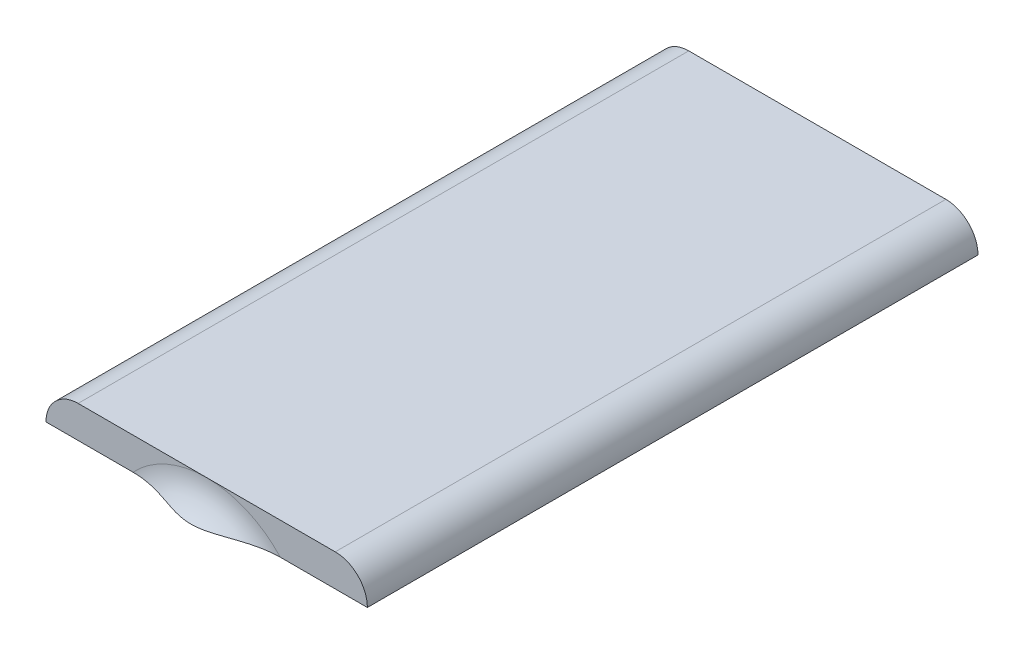
ISO-10303-21;
HEADER;
FILE_DESCRIPTION(('STEP AP214'),'2;1');
FILE_NAME('part.step','',(''),(''),'','','');
FILE_SCHEMA(('AUTOMOTIVE_DESIGN { 1 0 10303 214 1 1 1 1 }'));
ENDSEC;
DATA;
#1=APPLICATION_CONTEXT('core data for automotive mechanical design processes');
#2=APPLICATION_PROTOCOL_DEFINITION('international standard','automotive_design',2000,#1);
#3=PRODUCT_CONTEXT('',#1,'mechanical');
#4=PRODUCT('Part','Part','',(#3));
#5=PRODUCT_RELATED_PRODUCT_CATEGORY('part','',(#4));
#6=PRODUCT_DEFINITION_FORMATION('','',#4);
#7=PRODUCT_DEFINITION_CONTEXT('part definition',#1,'design');
#8=PRODUCT_DEFINITION('design','',#6,#7);
#9=PRODUCT_DEFINITION_SHAPE('','',#8);
#10=(LENGTH_UNIT() NAMED_UNIT(*) SI_UNIT(.MILLI.,.METRE.));
#11=(NAMED_UNIT(*) PLANE_ANGLE_UNIT() SI_UNIT($,.RADIAN.));
#12=(NAMED_UNIT(*) SI_UNIT($,.STERADIAN.) SOLID_ANGLE_UNIT());
#13=UNCERTAINTY_MEASURE_WITH_UNIT(LENGTH_MEASURE(1.E-05),#10,'distance_accuracy_value','');
#14=(GEOMETRIC_REPRESENTATION_CONTEXT(3) GLOBAL_UNCERTAINTY_ASSIGNED_CONTEXT((#13)) GLOBAL_UNIT_ASSIGNED_CONTEXT((#10,
#11,#12)) REPRESENTATION_CONTEXT('',''));
#15=CARTESIAN_POINT('',(0.,0.,0.));
#16=DIRECTION('',(0.,0.,1.));
#17=DIRECTION('',(1.,0.,0.));
#18=AXIS2_PLACEMENT_3D('',#15,#16,#17);
#19=CARTESIAN_POINT('',(-20.,8.5,10.01));
#20=DIRECTION('',(0.,1.,0.));
#21=DIRECTION('',(-1.,0.,0.));
#22=AXIS2_PLACEMENT_3D('',#19,#20,#21);
#23=PLANE('',#22);
#24=DIRECTION('',(-1.,0.,0.));
#25=VECTOR('',#24,1.);
#26=CARTESIAN_POINT('',(0.,8.49999999999999,-1.));
#27=LINE('',#26,#25);
#28=CARTESIAN_POINT('',(18.8729833462074,8.49999999999998,-1.));
#29=VERTEX_POINT('',#28);
#30=CARTESIAN_POINT('',(-18.8729833462074,8.5,-1.));
#31=VERTEX_POINT('',#30);
#32=EDGE_CURVE('E242',#29,#31,#27,.T.);
#33=ORIENTED_EDGE('',*,*,#32,.F.);
#34=DIRECTION('',(0.,0.,-1.));
#35=VECTOR('',#34,1.);
#36=CARTESIAN_POINT('',(18.8729833462074,8.49999999999998,-76.));
#37=LINE('',#36,#35);
#38=CARTESIAN_POINT('',(18.8729833462074,8.49999999999998,-76.));
#39=VERTEX_POINT('',#38);
#40=EDGE_CURVE('E191',#39,#29,#37,.F.);
#41=ORIENTED_EDGE('',*,*,#40,.F.);
#42=DIRECTION('',(1.,0.,0.));
#43=VECTOR('',#42,1.);
#44=CARTESIAN_POINT('',(0.,8.49999999999999,-76.));
#45=LINE('',#44,#43);
#46=CARTESIAN_POINT('',(20.,8.5,-76.));
#47=VERTEX_POINT('',#46);
#48=EDGE_CURVE('E156',#39,#47,#45,.T.);
#49=ORIENTED_EDGE('',*,*,#48,.T.);
#50=DIRECTION('',(0.,0.,1.));
#51=VECTOR('',#50,1.);
#52=CARTESIAN_POINT('',(20.,8.5,-1.));
#53=LINE('',#52,#51);
#54=CARTESIAN_POINT('',(20.,8.5,0.));
#55=VERTEX_POINT('',#54);
#56=EDGE_CURVE('E11',#47,#55,#53,.T.);
#57=ORIENTED_EDGE('',*,*,#56,.T.);
#58=DIRECTION('',(-1.,0.,0.));
#59=VECTOR('',#58,1.);
#60=CARTESIAN_POINT('',(0.,8.49999999999999,0.));
#61=LINE('',#60,#59);
#62=CARTESIAN_POINT('',(9.1651513899117,8.49999999999998,0.));
#63=VERTEX_POINT('',#62);
#64=EDGE_CURVE('E65',#55,#63,#61,.T.);
#65=ORIENTED_EDGE('',*,*,#64,.T.);
#66=CARTESIAN_POINT('',(0.,8.49999999999999,2.00000000000002));
#67=CARTESIAN_POINT('',(0.105152350395983,8.49999999999999,2.00000221259254));
#68=CARTESIAN_POINT('',(0.210298998756906,8.49999999999999,1.99739070368747));
#69=CARTESIAN_POINT('',(0.42034572113057,8.49999999999999,1.98704964671032));
#70=CARTESIAN_POINT('',(0.525245781803692,8.49999999999999,1.97931982786965));
#71=CARTESIAN_POINT('',(0.73486298021603,8.49999999999999,1.95899425906992));
#72=CARTESIAN_POINT('',(0.839578793785848,8.49999999999999,1.94638501052997));
#73=CARTESIAN_POINT('',(1.04837084678324,8.49999999999999,1.91673631174291));
#74=CARTESIAN_POINT('',(1.15244709736312,8.49999999999999,1.89969693897127));
#75=CARTESIAN_POINT('',(1.46642990391755,8.49999999999999,1.84218850126788));
#76=CARTESIAN_POINT('',(1.67522369713419,8.49999999999999,1.79563209095554));
#77=CARTESIAN_POINT('',(2.08969770750147,8.49999999999999,1.69123499207015));
#78=CARTESIAN_POINT('',(2.29537995452688,8.49999999999999,1.63340203519513));
#79=CARTESIAN_POINT('',(2.67184645669517,8.49999999999999,1.52059889951508));
#80=CARTESIAN_POINT('',(2.84294372378735,8.49999999999999,1.46665383010852));
#81=CARTESIAN_POINT('',(3.18424352849812,8.49999999999999,1.35600913320358));
#82=CARTESIAN_POINT('',(3.35444602414877,8.49999999999999,1.29930937775583));
#83=CARTESIAN_POINT('',(3.69461010478852,8.49999999999999,1.1849522034045));
#84=CARTESIAN_POINT('',(3.8645715483895,8.49999999999999,1.12729436846295));
#85=CARTESIAN_POINT('',(4.20470236944082,8.49999999999999,1.01257962518732));
#86=CARTESIAN_POINT('',(4.3748717512446,8.49999999999999,0.9555227296838));
#87=CARTESIAN_POINT('',(4.71492564168928,8.49999999999999,0.843641376637484));
#88=CARTESIAN_POINT('',(4.88480666732878,8.49999999999999,0.788806466457796));
#89=CARTESIAN_POINT('',(5.22552365385838,8.49999999999999,0.682196976105023));
#90=CARTESIAN_POINT('',(5.39635962136752,8.49999999999999,0.630422417173167));
#91=CARTESIAN_POINT('',(5.91066216199367,8.49999999999999,0.481295594893324));
#92=CARTESIAN_POINT('',(6.25599353005679,8.49999999999998,0.390116125139748));
#93=CARTESIAN_POINT('',(6.87448772997122,8.49999999999998,0.249612987801037));
#94=CARTESIAN_POINT('',(7.14654606910131,8.49999999999998,0.195489384455061));
#95=CARTESIAN_POINT('',(7.69360282976711,8.49999999999998,0.105219154060638));
#96=CARTESIAN_POINT('',(7.96860012368069,8.49999999999998,0.0690658683993698));
#97=CARTESIAN_POINT('',(8.52091269191232,8.49999999999998,0.0179831227448284));
#98=CARTESIAN_POINT('',(8.79823005765557,8.49999999999998,0.00307550877143504));
#99=CARTESIAN_POINT('',(9.35309645029777,8.49999999999998,-0.00221834348374518));
#100=CARTESIAN_POINT('',(9.63064529998875,8.49999999999998,0.00738354746609526));
#101=CARTESIAN_POINT('',(10.0957914470036,8.49999999999998,0.046714601124058));
#102=CARTESIAN_POINT('',(10.2840215782206,8.49999999999998,0.06910121648842));
#103=CARTESIAN_POINT('',(10.6583207584452,8.49999999999998,0.127612614267217));
#104=CARTESIAN_POINT('',(10.8443903733071,8.49999999999998,0.163733711884864));
#105=CARTESIAN_POINT('',(11.212890955012,8.49999999999998,0.250463663739517));
#106=CARTESIAN_POINT('',(11.3953262996903,8.49999999999998,0.301053798119982));
#107=CARTESIAN_POINT('',(11.7553048889751,8.49999999999998,0.417409793379787));
#108=CARTESIAN_POINT('',(11.9328488706118,8.49999999999998,0.483173353773766));
#109=CARTESIAN_POINT('',(12.2525958764997,8.49999999999998,0.618219552850558));
#110=CARTESIAN_POINT('',(12.3958001767723,8.49999999999998,0.685135096706459));
#111=CARTESIAN_POINT('',(12.6765319862256,8.49999999999998,0.830064369343367));
#112=CARTESIAN_POINT('',(12.8140586000983,8.49999999999998,0.908079839900541));
#113=CARTESIAN_POINT('',(13.0822294706484,8.49999999999998,1.07524167928402));
#114=CARTESIAN_POINT('',(13.2128723272721,8.49999999999998,1.16439030009716));
#115=CARTESIAN_POINT('',(13.4659503219349,8.49999999999998,1.35365559395905));
#116=CARTESIAN_POINT('',(13.5883865751732,8.49999999999998,1.45377077186669));
#117=CARTESIAN_POINT('',(13.8246553577133,8.49999999999998,1.6654758729366));
#118=CARTESIAN_POINT('',(13.938413431903,8.49999999999998,1.77714911101065));
#119=CARTESIAN_POINT('',(14.154818067776,8.49999999999998,2.01070811538585));
#120=CARTESIAN_POINT('',(14.2574700979499,8.49999999999998,2.1325888027216));
#121=CARTESIAN_POINT('',(14.4503256130799,8.49999999999998,2.38578211760428));
#122=CARTESIAN_POINT('',(14.5405333447314,8.49999999999998,2.51709150417299));
#123=CARTESIAN_POINT('',(14.7072304614101,8.49999999999998,2.7881441132429));
#124=CARTESIAN_POINT('',(14.7837221885785,8.49999999999998,2.92788589037417));
#125=CARTESIAN_POINT('',(14.9126247735831,8.49999999999998,3.19545284724255));
#126=CARTESIAN_POINT('',(14.9668855236494,8.49999999999998,3.32238969592003));
#127=CARTESIAN_POINT('',(15.0635591753504,8.49999999999998,3.58069288011773));
#128=CARTESIAN_POINT('',(15.1059735669904,8.49999999999998,3.71205865624708));
#129=CARTESIAN_POINT('',(15.1784010465613,8.49999999999998,3.97809722241245));
#130=CARTESIAN_POINT('',(15.2084203258523,8.49999999999998,4.11276832573512));
#131=CARTESIAN_POINT('',(15.2556942940673,8.49999999999998,4.38433264560028));
#132=CARTESIAN_POINT('',(15.272949716299,8.49999999999998,4.52122573402367));
#133=CARTESIAN_POINT('',(15.2935121425811,8.49999999999998,4.78379827286201));
#134=CARTESIAN_POINT('',(15.2979229574827,8.49999999999998,4.90939251610827));
#135=CARTESIAN_POINT('',(15.2959143952797,8.49999999999998,5.16053782679112));
#136=CARTESIAN_POINT('',(15.2894915681469,8.49999999999998,5.28608886773379));
#137=CARTESIAN_POINT('',(15.2658866985552,8.49999999999998,5.53610215619957));
#138=CARTESIAN_POINT('',(15.2487106722615,8.49999999999998,5.66056497310446));
#139=CARTESIAN_POINT('',(15.2037864676481,8.49999999999998,5.90761399598878));
#140=CARTESIAN_POINT('',(15.176034367009,8.49999999999998,6.030199488164));
#141=CARTESIAN_POINT('',(15.110867414279,8.49999999999998,6.27034340417592));
#142=CARTESIAN_POINT('',(15.0736401479179,8.49999999999998,6.38795284244734));
#143=CARTESIAN_POINT('',(14.989655983432,8.49999999999998,6.61976182210354));
#144=CARTESIAN_POINT('',(14.9428957164377,8.49999999999998,6.73396014162985));
#145=CARTESIAN_POINT('',(14.8403307817374,8.49999999999998,6.95816972468594));
#146=CARTESIAN_POINT('',(14.7845291169631,8.49999999999998,7.06818236348242));
#147=CARTESIAN_POINT('',(14.6643769060363,8.49999999999998,7.28348094325468));
#148=CARTESIAN_POINT('',(14.6000231454255,8.49999999999998,7.38876508693412));
#149=CARTESIAN_POINT('',(14.4604490555315,8.49999999999998,7.59839531552918));
#150=CARTESIAN_POINT('',(14.3848832681598,8.49999999999998,7.70251160535641));
#151=CARTESIAN_POINT('',(14.225792778184,8.49999999999998,7.90449462949111));
#152=CARTESIAN_POINT('',(14.1422651763385,8.49999999999998,8.00235906539486));
#153=CARTESIAN_POINT('',(13.8808316760334,8.49999999999998,8.28589054465437));
#154=CARTESIAN_POINT('',(13.6919828370406,8.49999999999998,8.46163278815322));
#155=CARTESIAN_POINT('',(13.2716482353414,8.49999999999998,8.79992638106247));
#156=CARTESIAN_POINT('',(13.0377993963288,8.49999999999998,8.95951092400368));
#157=CARTESIAN_POINT('',(12.5494140090783,8.49999999999998,9.24317179653353));
#158=CARTESIAN_POINT('',(12.2948650238935,8.49999999999998,9.36722657390813));
#159=CARTESIAN_POINT('',(11.8476771576099,8.49999999999998,9.54952451659199));
#160=CARTESIAN_POINT('',(11.6584758204459,8.49999999999998,9.61642119170653));
#161=CARTESIAN_POINT('',(11.2748603417463,8.49999999999998,9.73333595371027));
#162=CARTESIAN_POINT('',(11.0804444330494,8.49999999999998,9.7833482386167));
#163=CARTESIAN_POINT('',(10.6881568699474,8.49999999999998,9.86729312906266));
#164=CARTESIAN_POINT('',(10.490284299209,8.49999999999998,9.90122140167707));
#165=CARTESIAN_POINT('',(10.0925181271397,8.49999999999998,9.9539879049034));
#166=CARTESIAN_POINT('',(9.89262394309161,8.49999999999998,9.97282165137347));
#167=CARTESIAN_POINT('',(9.40233392761441,8.49999999999998,10.0017701274676));
#168=CARTESIAN_POINT('',(9.11147528398776,8.49999999999998,10.0042096080169));
#169=CARTESIAN_POINT('',(8.53058712758544,8.49999999999998,9.98327477280325));
#170=CARTESIAN_POINT('',(8.24055854190776,8.49999999999998,9.95987827622496));
#171=CARTESIAN_POINT('',(7.66062285309475,8.49999999999998,9.89067542838672));
#172=CARTESIAN_POINT('',(7.37074030235592,8.49999999999998,9.84466942051028));
#173=CARTESIAN_POINT('',(6.79504849558419,8.49999999999998,9.73418050310991));
#174=CARTESIAN_POINT('',(6.50923386170419,8.49999999999999,9.66972494949724));
#175=CARTESIAN_POINT('',(5.97274571272873,8.49999999999999,9.53431545188217));
#176=CARTESIAN_POINT('',(5.72168347007245,8.49999999999999,9.46486992399547));
#177=CARTESIAN_POINT('',(5.22201608846108,8.49999999999999,9.31759982810571));
#178=CARTESIAN_POINT('',(4.97341137487337,8.49999999999999,9.23977383634501));
#179=CARTESIAN_POINT('',(4.47637426606136,8.49999999999999,9.07866015439305));
#180=CARTESIAN_POINT('',(4.22795166195153,8.49999999999999,8.99534277368388));
#181=CARTESIAN_POINT('',(3.73145982259427,8.49999999999999,8.8277098952498));
#182=CARTESIAN_POINT('',(3.48339057636637,8.49999999999999,8.74339442933305));
#183=CARTESIAN_POINT('',(2.99456332282083,8.49999999999999,8.58168241922474));
#184=CARTESIAN_POINT('',(2.75385243641007,8.49999999999999,8.50414708809212));
#185=CARTESIAN_POINT('',(2.26939493350961,8.49999999999999,8.35864577869759));
#186=CARTESIAN_POINT('',(2.02564738340937,8.49999999999999,8.29068282661106));
#187=CARTESIAN_POINT('',(1.5370013811639,8.49999999999999,8.17247116090103));
#188=CARTESIAN_POINT('',(1.29215886883384,8.49999999999999,8.12200410679422));
#189=CARTESIAN_POINT('',(0.922195041994337,8.49999999999999,8.06434407092854));
#190=CARTESIAN_POINT('',(0.798478077751569,8.49999999999999,8.04813394618438));
#191=CARTESIAN_POINT('',(0.550336236164693,8.49999999999999,8.02244624233946));
#192=CARTESIAN_POINT('',(0.425911375393601,8.49999999999999,8.01296850627091));
#193=CARTESIAN_POINT('',(0.170942146293617,8.49999999999999,8.00097055418317));
#194=CARTESIAN_POINT('',(0.0403812828877034,8.49999999999999,7.99879294783874));
#195=CARTESIAN_POINT('',(-0.220626323455768,8.49999999999999,8.00248085637764));
#196=CARTESIAN_POINT('',(-0.351073064371248,8.49999999999999,8.00834651099867));
#197=CARTESIAN_POINT('',(-0.611496596199138,8.49999999999999,8.02778872820287));
#198=CARTESIAN_POINT('',(-0.741472871499637,8.49999999999999,8.04137208326543));
#199=CARTESIAN_POINT('',(-1.00049392530616,8.49999999999999,8.0755162689781));
#200=CARTESIAN_POINT('',(-1.12953866116156,8.49999999999999,8.09607741706368));
#201=CARTESIAN_POINT('',(-1.51822345283902,8.49999999999999,8.16735879907373));
#202=CARTESIAN_POINT('',(-1.77614535466746,8.49999999999999,8.22738997430267));
#203=CARTESIAN_POINT('',(-2.28765758534091,8.49999999999999,8.36306916036679));
#204=CARTESIAN_POINT('',(-2.54124693022877,8.49999999999999,8.43872066896674));
#205=CARTESIAN_POINT('',(-3.05444674413719,8.49999999999999,8.60052809962301));
#206=CARTESIAN_POINT('',(-3.3139703905254,8.49999999999999,8.68695294633474));
#207=CARTESIAN_POINT('',(-3.83236957641188,8.49999999999999,8.86151776900769));
#208=CARTESIAN_POINT('',(-4.09124522252778,8.49999999999999,8.9496574385788));
#209=CARTESIAN_POINT('',(-4.60862977770645,8.49999999999999,9.12203671993077));
#210=CARTESIAN_POINT('',(-4.86713194005456,8.49999999999999,9.20629616593248));
#211=CARTESIAN_POINT('',(-5.38645813866802,8.49999999999999,9.36732414295811));
#212=CARTESIAN_POINT('',(-5.64728182431097,8.49999999999999,9.44409378490939));
#213=CARTESIAN_POINT('',(-6.15529372106968,8.49999999999999,9.58202058746743));
#214=CARTESIAN_POINT('',(-6.40229402873017,8.49999999999999,9.64386020115533));
#215=CARTESIAN_POINT('',(-6.89947485729228,8.49999999999999,9.75516651103879));
#216=CARTESIAN_POINT('',(-7.14965934444339,8.49999999999999,9.80461577366555));
#217=CARTESIAN_POINT('',(-7.65054512937637,8.49999999999999,9.88805136037542));
#218=CARTESIAN_POINT('',(-7.90122556607985,8.49999999999999,9.92216052232583));
#219=CARTESIAN_POINT('',(-8.40428229510906,8.49999999999999,9.97298529283649));
#220=CARTESIAN_POINT('',(-8.65665776858856,8.49999999999999,9.98970876628851));
#221=CARTESIAN_POINT('',(-9.16720678227925,8.49999999999999,10.0034845458831));
#222=CARTESIAN_POINT('',(-9.42539281262439,8.49999999999999,10.0001251855111));
#223=CARTESIAN_POINT('',(-9.94058498718229,8.49999999999999,9.97026331751273));
#224=CARTESIAN_POINT('',(-10.1975907317184,8.49999999999999,9.94375347887848));
#225=CARTESIAN_POINT('',(-10.7074935707679,8.49999999999999,9.86531024544228));
#226=CARTESIAN_POINT('',(-10.9603946160195,8.49999999999999,9.81340300443286));
#227=CARTESIAN_POINT('',(-11.4589438167466,8.49999999999999,9.68219434533117));
#228=CARTESIAN_POINT('',(-11.7045974472413,8.5,9.60291421264339));
#229=CARTESIAN_POINT('',(-12.0917505908485,8.5,9.45180550707142));
#230=CARTESIAN_POINT('',(-12.2367943620558,8.5,9.38894937701312));
#231=CARTESIAN_POINT('',(-12.521575220929,8.5,9.25220905058261));
#232=CARTESIAN_POINT('',(-12.6613137348442,8.5,9.17832784487291));
#233=CARTESIAN_POINT('',(-12.934304577498,8.5,9.01946859211034));
#234=CARTESIAN_POINT('',(-13.0675584247777,8.5,8.93449316037086));
#235=CARTESIAN_POINT('',(-13.3263753240656,8.5,8.75350108202155));
#236=CARTESIAN_POINT('',(-13.4519380372715,8.5,8.65748394954884));
#237=CARTESIAN_POINT('',(-13.6949828434978,8.5,8.45388356588069));
#238=CARTESIAN_POINT('',(-13.8123953703648,8.5,8.34621704840909));
#239=CARTESIAN_POINT('',(-14.0366743909484,8.5,8.1204115794999));
#240=CARTESIAN_POINT('',(-14.1435421961545,8.5,8.00227393387704));
#241=CARTESIAN_POINT('',(-14.345328794782,8.5,7.75626010359892));
#242=CARTESIAN_POINT('',(-14.4402523290938,8.5,7.62838781534605));
#243=CARTESIAN_POINT('',(-14.6168602758124,8.5,7.36380653099042));
#244=CARTESIAN_POINT('',(-14.6985467416366,8.5,7.22709891009137));
#245=CARTESIAN_POINT('',(-14.838389973938,8.5,6.96314682614533));
#246=CARTESIAN_POINT('',(-14.8982006047673,8.5,6.83677643353394));
#247=CARTESIAN_POINT('',(-15.0059368757583,8.5,6.57907249841518));
#248=CARTESIAN_POINT('',(-15.0538640834647,8.5,6.44773961314782));
#249=CARTESIAN_POINT('',(-15.1372024434313,8.5,6.18122886532751));
#250=CARTESIAN_POINT('',(-15.1726197517001,8.5,6.0460529293895));
#251=CARTESIAN_POINT('',(-15.2304992377843,8.5,5.77295575188385));
#252=CARTESIAN_POINT('',(-15.2529623105624,8.5,5.63503470064782));
#253=CARTESIAN_POINT('',(-15.2831229046402,8.5,5.37090241600618));
#254=CARTESIAN_POINT('',(-15.2920230278337,8.5,5.24482709307061));
#255=CARTESIAN_POINT('',(-15.2988762692403,8.5,4.99233494886587));
#256=CARTESIAN_POINT('',(-15.2968259101566,8.5,4.86591803186283));
#257=CARTESIAN_POINT('',(-15.2817967596544,8.5,4.61381358651196));
#258=CARTESIAN_POINT('',(-15.2688245107871,8.5,4.48812566684704));
#259=CARTESIAN_POINT('',(-15.2320991851372,8.5,4.23828822472262));
#260=CARTESIAN_POINT('',(-15.2083421240398,8.5,4.11413928825031));
#261=CARTESIAN_POINT('',(-15.1510362885981,8.5,3.87140496892541));
#262=CARTESIAN_POINT('',(-15.1177472761768,8.5,3.75275809742434));
#263=CARTESIAN_POINT('',(-15.0415000990784,8.5,3.51856982723389));
#264=CARTESIAN_POINT('',(-14.9985385264339,8.5,3.40302953919874));
#265=CARTESIAN_POINT('',(-14.9033978456138,8.5,3.17586122127706));
#266=CARTESIAN_POINT('',(-14.8512220142937,8.5,3.06423181742453));
#267=CARTESIAN_POINT('',(-14.7381237248688,8.5,2.84545076731303));
#268=CARTESIAN_POINT('',(-14.6771979780764,8.5,2.73830082431421));
#269=CARTESIAN_POINT('',(-14.544773143565,8.5,2.5252369507554));
#270=CARTESIAN_POINT('',(-14.4729677056394,8.5,2.41951325197459));
#271=CARTESIAN_POINT('',(-14.3212297572969,8.5,2.21404927733615));
#272=CARTESIAN_POINT('',(-14.2412942915607,8.5,2.11431119839014));
#273=CARTESIAN_POINT('',(-13.9903461508326,8.5,1.82480426433536));
#274=CARTESIAN_POINT('',(-13.8081050278352,8.5,1.64460472831149));
#275=CARTESIAN_POINT('',(-13.4017476953845,8.5,1.29713864081541));
#276=CARTESIAN_POINT('',(-13.1753181926289,8.5,1.13260540735627));
#277=CARTESIAN_POINT('',(-12.700901987371,8.5,0.838235635364617));
#278=CARTESIAN_POINT('',(-12.4529052315294,8.5,0.708415394047156));
#279=CARTESIAN_POINT('',(-12.0182993743924,8.5,0.516761487945382));
#280=CARTESIAN_POINT('',(-11.8354450760456,8.5,0.446199128078776));
#281=CARTESIAN_POINT('',(-11.4641841772041,8.5,0.321386804605866));
#282=CARTESIAN_POINT('',(-11.2757757456325,8.49999999999999,0.26714228819258));
#283=CARTESIAN_POINT('',(-10.894986635551,8.49999999999999,0.174248299375225));
#284=CARTESIAN_POINT('',(-10.7026020896644,8.49999999999999,0.135614841598354));
#285=CARTESIAN_POINT('',(-10.3155010613842,8.49999999999999,0.0731340844065417));
#286=CARTESIAN_POINT('',(-10.1207847651407,8.49999999999999,0.0492856125815113));
#287=CARTESIAN_POINT('',(-9.64804265496463,8.49999999999999,0.00825481419880368));
#288=CARTESIAN_POINT('',(-9.36939923722985,8.49999999999999,-0.00191273417702614));
#289=CARTESIAN_POINT('',(-8.81219783234067,8.49999999999999,0.00250491853848194));
#290=CARTESIAN_POINT('',(-8.53364013071271,8.49999999999999,0.0171116750989745));
#291=CARTESIAN_POINT('',(-7.97681639557285,8.49999999999999,0.0680108304398643));
#292=CARTESIAN_POINT('',(-7.69856323126912,8.49999999999999,0.104439131764387));
#293=CARTESIAN_POINT('',(-7.1456008173067,8.49999999999999,0.195607150666932));
#294=CARTESIAN_POINT('',(-6.87088669647126,8.49999999999999,0.250318077150725));
#295=CARTESIAN_POINT('',(-6.31700095061199,8.49999999999999,0.376375753798967));
#296=CARTESIAN_POINT('',(-6.03792998548801,8.49999999999999,0.448157628732343));
#297=CARTESIAN_POINT('',(-5.6217994743589,8.49999999999999,0.56460971138427));
#298=CARTESIAN_POINT('',(-5.48348051088825,8.49999999999999,0.604897275128311));
#299=CARTESIAN_POINT('',(-5.207560988575,8.49999999999999,0.687857032466175));
#300=CARTESIAN_POINT('',(-5.06996041377347,8.49999999999999,0.730529172838233));
#301=CARTESIAN_POINT('',(-4.65631566726706,8.49999999999999,0.861834936781911));
#302=CARTESIAN_POINT('',(-4.38116559962829,8.49999999999999,0.953257174370644));
#303=CARTESIAN_POINT('',(-3.8315930798443,8.49999999999999,1.13826756973078));
#304=CARTESIAN_POINT('',(-3.55717067822723,8.49999999999999,1.23185587373703));
#305=CARTESIAN_POINT('',(-3.01435927921297,8.49999999999999,1.41204790288449));
#306=CARTESIAN_POINT('',(-2.74601118532509,8.49999999999999,1.49877278292717));
#307=CARTESIAN_POINT('',(-2.20535768892762,8.49999999999999,1.65994271404873));
#308=CARTESIAN_POINT('',(-1.93305120190449,8.49999999999999,1.73438432805342));
#309=CARTESIAN_POINT('',(-1.52202086267759,8.49999999999999,1.82872971574828));
#310=CARTESIAN_POINT('',(-1.38528728191344,8.49999999999999,1.85718996338336));
#311=CARTESIAN_POINT('',(-1.1105789795402,8.49999999999999,1.90721719304996));
#312=CARTESIAN_POINT('',(-0.972604582910851,8.49999999999999,1.92878592890254));
#313=CARTESIAN_POINT('',(-0.695801249774455,8.49999999999999,1.96383252682039));
#314=CARTESIAN_POINT('',(-0.55697370028772,8.49999999999999,1.97732115378597));
#315=CARTESIAN_POINT('',(-0.278760654539624,8.49999999999999,1.99540222756443));
#316=CARTESIAN_POINT('',(-0.139375318470123,8.49999999999999,1.99999706729536));
#317=CARTESIAN_POINT('',(0.,8.49999999999999,2.00000000000002));
#318=B_SPLINE_CURVE_WITH_KNOTS('',3,(#66,#67,#68,#69,#70,#71,#72,#73,#74,#75,#76,#77,#78,#79,
#80,#81,#82,#83,#84,#85,#86,#87,#88,#89,#90,#91,#92,#93,#94,#95,#96,#97,#98,#99,#100,#101,#102,
#103,#104,#105,#106,#107,#108,#109,#110,#111,#112,#113,#114,#115,#116,#117,#118,#119,#120,#121,
#122,#123,#124,#125,#126,#127,#128,#129,#130,#131,#132,#133,#134,#135,#136,#137,#138,#139,#140,
#141,#142,#143,#144,#145,#146,#147,#148,#149,#150,#151,#152,#153,#154,#155,#156,#157,#158,#159,
#160,#161,#162,#163,#164,#165,#166,#167,#168,#169,#170,#171,#172,#173,#174,#175,#176,#177,#178,
#179,#180,#181,#182,#183,#184,#185,#186,#187,#188,#189,#190,#191,#192,#193,#194,#195,#196,#197,
#198,#199,#200,#201,#202,#203,#204,#205,#206,#207,#208,#209,#210,#211,#212,#213,#214,#215,#216,
#217,#218,#219,#220,#221,#222,#223,#224,#225,#226,#227,#228,#229,#230,#231,#232,#233,#234,#235,
#236,#237,#238,#239,#240,#241,#242,#243,#244,#245,#246,#247,#248,#249,#250,#251,#252,#253,#254,
#255,#256,#257,#258,#259,#260,#261,#262,#263,#264,#265,#266,#267,#268,#269,#270,#271,#272,#273,
#274,#275,#276,#277,#278,#279,#280,#281,#282,#283,#284,#285,#286,#287,#288,#289,#290,#291,#292,
#293,#294,#295,#296,#297,#298,#299,#300,#301,#302,#303,#304,#305,#306,#307,#308,#309,#310,#311,
#312,#313,#314,#315,#316,#317),.UNSPECIFIED.,.T.,.F.,(4,2,2,2,2,2,2,2,2,2,2,2,2,2,2,2,2,2,2,2,2,
2,2,2,2,2,2,2,2,2,2,2,2,2,2,2,2,2,2,2,2,2,2,2,2,2,2,2,2,2,2,2,2,2,2,2,2,2,2,2,2,2,2,2,2,2,2,2,2,
2,2,2,2,2,2,2,2,2,2,2,2,2,2,2,2,2,2,2,2,2,2,2,2,2,2,2,2,2,2,2,2,2,2,2,2,2,2,2,2,2,2,2,2,2,2,2,2,
2,2,2,2,2,2,2,2,4),(0.,0.315415538976836,0.630847765384356,0.947158922934194,1.26346454910299,
1.90469880437228,2.54549493741309,3.08365601871096,3.62184212039917,4.16026837089096,
4.69870609403131,5.23421582060143,5.76972926359119,6.84053380331758,7.67222107545717,
8.50359994907191,9.33583307892036,10.167663207075,10.735888298042,11.3039610484777,
11.8713021327766,12.4385572573706,12.9123045241466,13.3861262124619,13.8600439000019,
14.3338970555323,14.8114416249139,15.2887499762151,15.7658950379477,16.2429585447712,
16.6565471825343,17.0700837767023,17.4834135586787,17.8967195922309,18.2732762729558,
18.6499528927055,19.0264189587335,19.4030247797802,19.7726871191403,20.1424803207279,
20.5121509532153,20.8819609281106,21.267478777068,21.6531375500022,22.4239648791329,
23.2701108835109,24.1167690748217,24.7180554398834,25.3195482151612,25.9212029366095,
26.5230363258821,27.3942351848798,28.2661825712104,29.1459720530226,30.0244637324007,
30.8057413104347,31.5871518298138,32.3732028961357,33.159228978731,33.9178123577298,
34.6766350166791,35.4256148133679,35.7997798198546,36.1739361022792,36.5654234212448,
36.9569175417094,37.348756757727,37.7406138017806,38.5341264555294,39.3278169887414,
40.1483788806757,40.9687954839723,41.7844025677705,42.5998884919017,43.3635054110169,
44.1281908021273,44.8866388180275,45.6447435797221,46.4184408615361,47.1923832371378,
47.9655302927612,48.7380774913511,49.2118999579793,49.6855941283577,50.1591768327064,
50.6327803838771,51.1100259886934,51.5872121615294,52.0642083293202,52.5411304314846,
52.9599915858237,53.3787974586754,53.7973969528745,54.2159675240359,54.5946700167813,
54.9734927726523,55.3520887632496,55.7308247353964,56.1000881369477,56.4694818465494,
56.8387444526978,57.208146212548,57.5911273635312,57.9742482316847,58.7400063906034,
59.5765174539527,60.4134205595429,61.0006825045091,61.5881402712074,62.1761991616286,
62.7642114145762,63.5993677473808,64.4352511004987,65.276395182738,66.1162208427127,
66.9803202428788,67.4125052136515,67.8446805422654,68.7144523689331,69.5842830876608,
70.4302617732833,71.2764767786788,71.6953260461756,72.1140686356506,72.5322520982582,
72.95032303086),.UNSPECIFIED.);
#319=CARTESIAN_POINT('',(-9.16515138991169,8.49999999999999,0.));
#320=VERTEX_POINT('',#319);
#321=EDGE_CURVE('E185',#320,#63,#318,.T.);
#322=ORIENTED_EDGE('',*,*,#321,.F.);
#323=DIRECTION('',(-1.,0.,0.));
#324=VECTOR('',#323,1.);
#325=CARTESIAN_POINT('',(0.,8.49999999999999,0.));
#326=LINE('',#325,#324);
#327=CARTESIAN_POINT('',(-20.,8.5,0.));
#328=VERTEX_POINT('',#327);
#329=EDGE_CURVE('E247',#320,#328,#326,.T.);
#330=ORIENTED_EDGE('',*,*,#329,.T.);
#331=DIRECTION('',(0.,0.,1.));
#332=VECTOR('',#331,1.);
#333=CARTESIAN_POINT('',(-20.,8.5,-1.));
#334=LINE('',#333,#332);
#335=CARTESIAN_POINT('',(-20.,8.5,-76.));
#336=VERTEX_POINT('',#335);
#337=EDGE_CURVE('E57',#328,#336,#334,.F.);
#338=ORIENTED_EDGE('',*,*,#337,.T.);
#339=CARTESIAN_POINT('',(-18.8729833462074,8.5,-76.));
#340=VERTEX_POINT('',#339);
#341=EDGE_CURVE('E272',#336,#340,#45,.T.);
#342=ORIENTED_EDGE('',*,*,#341,.T.);
#343=DIRECTION('',(0.,0.,-1.));
#344=VECTOR('',#343,1.);
#345=CARTESIAN_POINT('',(-18.8729833462074,8.5,-76.));
#346=LINE('',#345,#344);
#347=EDGE_CURVE('E51',#31,#340,#346,.T.);
#348=ORIENTED_EDGE('',*,*,#347,.F.);
#349=EDGE_LOOP('',(#33,#41,#49,#57,#65,#322,#330,#338,#342,#348));
#350=FACE_BOUND('',#349,.T.);
#351=ADVANCED_FACE('F47',(#350),#23,.F.);
#352=CARTESIAN_POINT('',(-20.,12.5,-1.));
#353=DIRECTION('',(0.,1.,0.));
#354=DIRECTION('',(0.,0.,1.));
#355=AXIS2_PLACEMENT_3D('',#352,#353,#354);
#356=PLANE('',#355);
#357=DIRECTION('',(-1.,0.,0.));
#358=VECTOR('',#357,1.);
#359=CARTESIAN_POINT('',(-20.,12.5,0.));
#360=LINE('',#359,#358);
#361=CARTESIAN_POINT('',(16.,12.5,0.));
#362=VERTEX_POINT('',#361);
#363=CARTESIAN_POINT('',(0.,12.5,0.));
#364=VERTEX_POINT('',#363);
#365=EDGE_CURVE('E125',#362,#364,#360,.T.);
#366=ORIENTED_EDGE('',*,*,#365,.F.);
#367=DIRECTION('',(0.,0.,1.));
#368=VECTOR('',#367,1.);
#369=CARTESIAN_POINT('',(16.,12.5,-1.));
#370=LINE('',#369,#368);
#371=CARTESIAN_POINT('',(16.,12.5,-76.));
#372=VERTEX_POINT('',#371);
#373=EDGE_CURVE('E135',#362,#372,#370,.F.);
#374=ORIENTED_EDGE('',*,*,#373,.T.);
#375=DIRECTION('',(1.,0.,0.));
#376=VECTOR('',#375,1.);
#377=CARTESIAN_POINT('',(-20.,12.5,-76.));
#378=LINE('',#377,#376);
#379=CARTESIAN_POINT('',(-16.,12.5,-76.));
#380=VERTEX_POINT('',#379);
#381=EDGE_CURVE('E257',#380,#372,#378,.T.);
#382=ORIENTED_EDGE('',*,*,#381,.F.);
#383=DIRECTION('',(0.,0.,1.));
#384=VECTOR('',#383,1.);
#385=CARTESIAN_POINT('',(-16.,12.5,-1.));
#386=LINE('',#385,#384);
#387=CARTESIAN_POINT('',(-16.,12.5,0.));
#388=VERTEX_POINT('',#387);
#389=EDGE_CURVE('E128',#380,#388,#386,.T.);
#390=ORIENTED_EDGE('',*,*,#389,.T.);
#391=EDGE_CURVE('E138',#364,#388,#360,.T.);
#392=ORIENTED_EDGE('',*,*,#391,.F.);
#393=EDGE_LOOP('',(#366,#374,#382,#390,#392));
#394=FACE_BOUND('',#393,.T.);
#395=ADVANCED_FACE('F133',(#394),#356,.T.);
#396=CARTESIAN_POINT('',(0.,0.,0.));
#397=DIRECTION('',(0.,0.,1.));
#398=DIRECTION('',(1.,0.,0.));
#399=AXIS2_PLACEMENT_3D('',#396,#397,#398);
#400=PLANE('',#399);
#401=ORIENTED_EDGE('',*,*,#64,.F.);
#402=CARTESIAN_POINT('',(16.,8.5,0.));
#403=DIRECTION('',(0.,0.,1.));
#404=DIRECTION('',(1.,0.,0.));
#405=AXIS2_PLACEMENT_3D('',#402,#403,#404);
#406=CIRCLE('',#405,4.);
#407=EDGE_CURVE('E122',#55,#362,#406,.T.);
#408=ORIENTED_EDGE('',*,*,#407,.T.);
#409=ORIENTED_EDGE('',*,*,#365,.T.);
#410=CARTESIAN_POINT('',(0.,0.,0.));
#411=DIRECTION('',(0.,0.,1.));
#412=DIRECTION('',(1.,0.,0.));
#413=AXIS2_PLACEMENT_3D('',#410,#411,#412);
#414=CIRCLE('',#413,12.5);
#415=EDGE_CURVE('E179',#364,#63,#414,.F.);
#416=ORIENTED_EDGE('',*,*,#415,.T.);
#417=EDGE_LOOP('',(#401,#408,#409,#416));
#418=FACE_BOUND('',#417,.T.);
#419=ADVANCED_FACE('F124',(#418),#400,.T.);
#420=ORIENTED_EDGE('',*,*,#329,.F.);
#421=CARTESIAN_POINT('',(0.,0.,0.));
#422=DIRECTION('',(0.,0.,1.));
#423=DIRECTION('',(1.,0.,0.));
#424=AXIS2_PLACEMENT_3D('',#421,#422,#423);
#425=CIRCLE('',#424,12.5);
#426=EDGE_CURVE('E182',#320,#364,#425,.F.);
#427=ORIENTED_EDGE('',*,*,#426,.T.);
#428=ORIENTED_EDGE('',*,*,#391,.T.);
#429=CARTESIAN_POINT('',(-16.,8.5,0.));
#430=DIRECTION('',(0.,0.,1.));
#431=DIRECTION('',(1.,0.,0.));
#432=AXIS2_PLACEMENT_3D('',#429,#430,#431);
#433=CIRCLE('',#432,4.);
#434=EDGE_CURVE('E129',#388,#328,#433,.T.);
#435=ORIENTED_EDGE('',*,*,#434,.T.);
#436=EDGE_LOOP('',(#420,#427,#428,#435));
#437=FACE_BOUND('',#436,.T.);
#438=ADVANCED_FACE('F198',(#437),#400,.T.);
#439=CARTESIAN_POINT('',(0.,0.,5.));
#440=DIRECTION('',(0.,0.,1.));
#441=DIRECTION('',(1.,0.,0.));
#442=AXIS2_PLACEMENT_3D('',#439,#440,#441);
#443=TOROIDAL_SURFACE('',#442,12.5,5.);
#444=ORIENTED_EDGE('',*,*,#426,.F.);
#445=ORIENTED_EDGE('',*,*,#321,.T.);
#446=ORIENTED_EDGE('',*,*,#415,.F.);
#447=EDGE_LOOP('',(#444,#445,#446));
#448=FACE_BOUND('',#447,.T.);
#449=ADVANCED_FACE('F193',(#448),#443,.F.);
#450=CARTESIAN_POINT('',(-19.,11.5,-76.));
#451=DIRECTION('',(0.,-1.,0.));
#452=DIRECTION('',(1.,0.,0.));
#453=AXIS2_PLACEMENT_3D('',#450,#451,#452);
#454=PLANE('',#453);
#455=DIRECTION('',(1.,0.,0.));
#456=VECTOR('',#455,1.);
#457=CARTESIAN_POINT('',(-19.,11.5,-1.));
#458=LINE('',#457,#456);
#459=CARTESIAN_POINT('',(-15.,11.5,-1.));
#460=VERTEX_POINT('',#459);
#461=CARTESIAN_POINT('',(15.,11.5,-1.));
#462=VERTEX_POINT('',#461);
#463=EDGE_CURVE('E249',#460,#462,#458,.T.);
#464=ORIENTED_EDGE('',*,*,#463,.F.);
#465=DIRECTION('',(0.,0.,1.));
#466=VECTOR('',#465,1.);
#467=CARTESIAN_POINT('',(-15.,11.5,-76.));
#468=LINE('',#467,#466);
#469=CARTESIAN_POINT('',(-15.,11.5,-76.));
#470=VERTEX_POINT('',#469);
#471=EDGE_CURVE('E164',#460,#470,#468,.F.);
#472=ORIENTED_EDGE('',*,*,#471,.T.);
#473=DIRECTION('',(1.,0.,0.));
#474=VECTOR('',#473,1.);
#475=CARTESIAN_POINT('',(-19.,11.5,-76.));
#476=LINE('',#475,#474);
#477=CARTESIAN_POINT('',(15.,11.5,-76.));
#478=VERTEX_POINT('',#477);
#479=EDGE_CURVE('E254',#470,#478,#476,.T.);
#480=ORIENTED_EDGE('',*,*,#479,.T.);
#481=DIRECTION('',(0.,0.,1.));
#482=VECTOR('',#481,1.);
#483=CARTESIAN_POINT('',(15.,11.5,-1.));
#484=LINE('',#483,#482);
#485=EDGE_CURVE('E160',#478,#462,#484,.T.);
#486=ORIENTED_EDGE('',*,*,#485,.T.);
#487=EDGE_LOOP('',(#464,#472,#480,#486));
#488=FACE_BOUND('',#487,.T.);
#489=ADVANCED_FACE('F197',(#488),#454,.T.);
#490=CARTESIAN_POINT('',(0.,0.,-1.));
#491=DIRECTION('',(0.,0.,1.));
#492=DIRECTION('',(1.,0.,0.));
#493=AXIS2_PLACEMENT_3D('',#490,#491,#492);
#494=PLANE('',#493);
#495=CARTESIAN_POINT('',(15.,7.5,-1.));
#496=DIRECTION('',(0.,0.,1.));
#497=DIRECTION('',(1.,0.,0.));
#498=AXIS2_PLACEMENT_3D('',#495,#496,#497);
#499=CIRCLE('',#498,4.);
#500=EDGE_CURVE('E145',#462,#29,#499,.F.);
#501=ORIENTED_EDGE('',*,*,#500,.T.);
#502=ORIENTED_EDGE('',*,*,#32,.T.);
#503=CARTESIAN_POINT('',(-15.,7.50000000000001,-1.));
#504=DIRECTION('',(0.,0.,1.));
#505=DIRECTION('',(1.,0.,0.));
#506=AXIS2_PLACEMENT_3D('',#503,#504,#505);
#507=CIRCLE('',#506,4.);
#508=EDGE_CURVE('E150',#31,#460,#507,.F.);
#509=ORIENTED_EDGE('',*,*,#508,.T.);
#510=ORIENTED_EDGE('',*,*,#463,.T.);
#511=EDGE_LOOP('',(#501,#502,#509,#510));
#512=FACE_BOUND('',#511,.T.);
#513=ADVANCED_FACE('F219',(#512),#494,.F.);
#514=CARTESIAN_POINT('',(0.,0.,-76.));
#515=DIRECTION('',(0.,0.,-1.));
#516=DIRECTION('',(-1.,0.,0.));
#517=AXIS2_PLACEMENT_3D('',#514,#515,#516);
#518=PLANE('',#517);
#519=ORIENTED_EDGE('',*,*,#341,.F.);
#520=CARTESIAN_POINT('',(-16.,8.5,-76.));
#521=DIRECTION('',(0.,0.,-1.));
#522=DIRECTION('',(-1.,0.,0.));
#523=AXIS2_PLACEMENT_3D('',#520,#521,#522);
#524=CIRCLE('',#523,4.);
#525=EDGE_CURVE('E174',#336,#380,#524,.T.);
#526=ORIENTED_EDGE('',*,*,#525,.T.);
#527=ORIENTED_EDGE('',*,*,#381,.T.);
#528=CARTESIAN_POINT('',(16.,8.5,-76.));
#529=DIRECTION('',(0.,0.,-1.));
#530=DIRECTION('',(-1.,0.,0.));
#531=AXIS2_PLACEMENT_3D('',#528,#529,#530);
#532=CIRCLE('',#531,4.);
#533=EDGE_CURVE('E143',#372,#47,#532,.T.);
#534=ORIENTED_EDGE('',*,*,#533,.T.);
#535=ORIENTED_EDGE('',*,*,#48,.F.);
#536=CARTESIAN_POINT('',(15.,7.5,-76.));
#537=DIRECTION('',(0.,0.,-1.));
#538=DIRECTION('',(-1.,0.,0.));
#539=AXIS2_PLACEMENT_3D('',#536,#537,#538);
#540=CIRCLE('',#539,4.);
#541=EDGE_CURVE('E171',#39,#478,#540,.F.);
#542=ORIENTED_EDGE('',*,*,#541,.T.);
#543=ORIENTED_EDGE('',*,*,#479,.F.);
#544=CARTESIAN_POINT('',(-15.,7.50000000000001,-76.));
#545=DIRECTION('',(0.,0.,-1.));
#546=DIRECTION('',(-1.,0.,0.));
#547=AXIS2_PLACEMENT_3D('',#544,#545,#546);
#548=CIRCLE('',#547,4.);
#549=EDGE_CURVE('E167',#470,#340,#548,.F.);
#550=ORIENTED_EDGE('',*,*,#549,.T.);
#551=EDGE_LOOP('',(#519,#526,#527,#534,#535,#542,#543,#550));
#552=FACE_BOUND('',#551,.T.);
#553=ADVANCED_FACE('F204',(#552),#518,.T.);
#554=CARTESIAN_POINT('',(15.,7.5,-76.));
#555=DIRECTION('',(0.,0.,-1.));
#556=DIRECTION('',(-1.,0.,0.));
#557=AXIS2_PLACEMENT_3D('',#554,#555,#556);
#558=CYLINDRICAL_SURFACE('',#557,4.);
#559=ORIENTED_EDGE('',*,*,#541,.F.);
#560=ORIENTED_EDGE('',*,*,#40,.T.);
#561=ORIENTED_EDGE('',*,*,#500,.F.);
#562=ORIENTED_EDGE('',*,*,#485,.F.);
#563=EDGE_LOOP('',(#559,#560,#561,#562));
#564=FACE_BOUND('',#563,.T.);
#565=ADVANCED_FACE('F200',(#564),#558,.F.);
#566=CARTESIAN_POINT('',(-15.,7.50000000000001,-76.));
#567=DIRECTION('',(0.,0.,-1.));
#568=DIRECTION('',(-1.,0.,0.));
#569=AXIS2_PLACEMENT_3D('',#566,#567,#568);
#570=CYLINDRICAL_SURFACE('',#569,4.);
#571=ORIENTED_EDGE('',*,*,#508,.F.);
#572=ORIENTED_EDGE('',*,*,#347,.T.);
#573=ORIENTED_EDGE('',*,*,#549,.F.);
#574=ORIENTED_EDGE('',*,*,#471,.F.);
#575=EDGE_LOOP('',(#571,#572,#573,#574));
#576=FACE_BOUND('',#575,.T.);
#577=ADVANCED_FACE('F203',(#576),#570,.F.);
#578=CARTESIAN_POINT('',(-16.,8.5,-1.));
#579=DIRECTION('',(0.,0.,1.));
#580=DIRECTION('',(1.,0.,0.));
#581=AXIS2_PLACEMENT_3D('',#578,#579,#580);
#582=CYLINDRICAL_SURFACE('',#581,4.);
#583=ORIENTED_EDGE('',*,*,#525,.F.);
#584=ORIENTED_EDGE('',*,*,#337,.F.);
#585=ORIENTED_EDGE('',*,*,#434,.F.);
#586=ORIENTED_EDGE('',*,*,#389,.F.);
#587=EDGE_LOOP('',(#583,#584,#585,#586));
#588=FACE_BOUND('',#587,.T.);
#589=ADVANCED_FACE('F208',(#588),#582,.T.);
#590=CARTESIAN_POINT('',(16.,8.5,-1.));
#591=DIRECTION('',(0.,0.,1.));
#592=DIRECTION('',(1.,0.,0.));
#593=AXIS2_PLACEMENT_3D('',#590,#591,#592);
#594=CYLINDRICAL_SURFACE('',#593,4.);
#595=ORIENTED_EDGE('',*,*,#533,.F.);
#596=ORIENTED_EDGE('',*,*,#373,.F.);
#597=ORIENTED_EDGE('',*,*,#407,.F.);
#598=ORIENTED_EDGE('',*,*,#56,.F.);
#599=EDGE_LOOP('',(#595,#596,#597,#598));
#600=FACE_BOUND('',#599,.T.);
#601=ADVANCED_FACE('F141',(#600),#594,.T.);
#602=CLOSED_SHELL('',(#351,#395,#419,#438,#449,#489,#513,#553,#565,#577,#589,#601));
#603=MANIFOLD_SOLID_BREP('B2',#602);
#604=ADVANCED_BREP_SHAPE_REPRESENTATION('',(#18,#603),#14);
#605=SHAPE_DEFINITION_REPRESENTATION(#9,#604);
ENDSEC;
END-ISO-10303-21;
